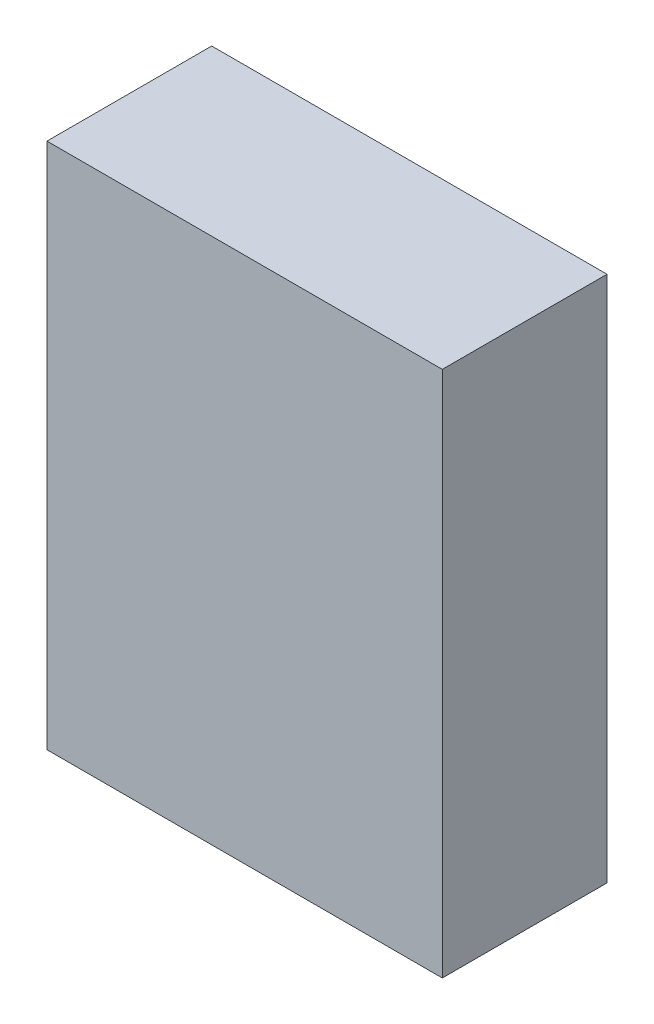
ISO-10303-21;
HEADER;
FILE_DESCRIPTION(('STEP AP214'),'2;1');
FILE_NAME('part.step','',(''),(''),'','','');
FILE_SCHEMA(('AUTOMOTIVE_DESIGN { 1 0 10303 214 1 1 1 1 }'));
ENDSEC;
DATA;
#1=APPLICATION_CONTEXT('core data for automotive mechanical design processes');
#2=APPLICATION_PROTOCOL_DEFINITION('international standard','automotive_design',2000,#1);
#3=PRODUCT_CONTEXT('',#1,'mechanical');
#4=PRODUCT('Part','Part','',(#3));
#5=PRODUCT_RELATED_PRODUCT_CATEGORY('part','',(#4));
#6=PRODUCT_DEFINITION_FORMATION('','',#4);
#7=PRODUCT_DEFINITION_CONTEXT('part definition',#1,'design');
#8=PRODUCT_DEFINITION('design','',#6,#7);
#9=PRODUCT_DEFINITION_SHAPE('','',#8);
#10=(LENGTH_UNIT() NAMED_UNIT(*) SI_UNIT(.MILLI.,.METRE.));
#11=(NAMED_UNIT(*) PLANE_ANGLE_UNIT() SI_UNIT($,.RADIAN.));
#12=(NAMED_UNIT(*) SI_UNIT($,.STERADIAN.) SOLID_ANGLE_UNIT());
#13=UNCERTAINTY_MEASURE_WITH_UNIT(LENGTH_MEASURE(1.E-05),#10,'distance_accuracy_value','');
#14=(GEOMETRIC_REPRESENTATION_CONTEXT(3) GLOBAL_UNCERTAINTY_ASSIGNED_CONTEXT((#13)) GLOBAL_UNIT_ASSIGNED_CONTEXT((#10,
#11,#12)) REPRESENTATION_CONTEXT('',''));
#15=CARTESIAN_POINT('',(0.,0.,0.));
#16=DIRECTION('',(0.,0.,1.));
#17=DIRECTION('',(1.,0.,0.));
#18=AXIS2_PLACEMENT_3D('',#15,#16,#17);
#19=CARTESIAN_POINT('',(300.,-400.,250.));
#20=DIRECTION('',(-1.,0.,0.));
#21=DIRECTION('',(0.,0.,1.));
#22=AXIS2_PLACEMENT_3D('',#19,#20,#21);
#23=PLANE('',#22);
#24=DIRECTION('',(0.,1.,0.));
#25=VECTOR('',#24,1.);
#26=CARTESIAN_POINT('',(300.,-400.,0.));
#27=LINE('',#26,#25);
#28=CARTESIAN_POINT('',(300.,-400.,0.));
#29=VERTEX_POINT('',#28);
#30=CARTESIAN_POINT('',(300.,400.,0.));
#31=VERTEX_POINT('',#30);
#32=EDGE_CURVE('E96',#29,#31,#27,.T.);
#33=ORIENTED_EDGE('',*,*,#32,.T.);
#34=DIRECTION('',(0.,0.,-1.));
#35=VECTOR('',#34,1.);
#36=CARTESIAN_POINT('',(300.,400.,250.));
#37=LINE('',#36,#35);
#38=CARTESIAN_POINT('',(300.,400.,250.));
#39=VERTEX_POINT('',#38);
#40=EDGE_CURVE('E11',#39,#31,#37,.T.);
#41=ORIENTED_EDGE('',*,*,#40,.F.);
#42=DIRECTION('',(0.,1.,0.));
#43=VECTOR('',#42,1.);
#44=CARTESIAN_POINT('',(300.,-400.,250.));
#45=LINE('',#44,#43);
#46=CARTESIAN_POINT('',(300.,-400.,250.));
#47=VERTEX_POINT('',#46);
#48=EDGE_CURVE('E84',#47,#39,#45,.T.);
#49=ORIENTED_EDGE('',*,*,#48,.F.);
#50=DIRECTION('',(0.,0.,-1.));
#51=VECTOR('',#50,1.);
#52=CARTESIAN_POINT('',(300.,-400.,250.));
#53=LINE('',#52,#51);
#54=EDGE_CURVE('E92',#47,#29,#53,.T.);
#55=ORIENTED_EDGE('',*,*,#54,.T.);
#56=EDGE_LOOP('',(#33,#41,#49,#55));
#57=FACE_BOUND('',#56,.T.);
#58=ADVANCED_FACE('F33',(#57),#23,.F.);
#59=CARTESIAN_POINT('',(-300.,400.,250.));
#60=DIRECTION('',(0.,-1.,0.));
#61=DIRECTION('',(0.,0.,-1.));
#62=AXIS2_PLACEMENT_3D('',#59,#60,#61);
#63=PLANE('',#62);
#64=DIRECTION('',(-1.,0.,0.));
#65=VECTOR('',#64,1.);
#66=CARTESIAN_POINT('',(-300.,400.,0.));
#67=LINE('',#66,#65);
#68=CARTESIAN_POINT('',(-300.,400.,0.));
#69=VERTEX_POINT('',#68);
#70=EDGE_CURVE('E88',#31,#69,#67,.T.);
#71=ORIENTED_EDGE('',*,*,#70,.T.);
#72=DIRECTION('',(0.,0.,-1.));
#73=VECTOR('',#72,1.);
#74=CARTESIAN_POINT('',(-300.,400.,250.));
#75=LINE('',#74,#73);
#76=CARTESIAN_POINT('',(-300.,400.,250.));
#77=VERTEX_POINT('',#76);
#78=EDGE_CURVE('E41',#77,#69,#75,.T.);
#79=ORIENTED_EDGE('',*,*,#78,.F.);
#80=DIRECTION('',(-1.,0.,0.));
#81=VECTOR('',#80,1.);
#82=CARTESIAN_POINT('',(-300.,400.,250.));
#83=LINE('',#82,#81);
#84=EDGE_CURVE('E79',#39,#77,#83,.T.);
#85=ORIENTED_EDGE('',*,*,#84,.F.);
#86=ORIENTED_EDGE('',*,*,#40,.T.);
#87=EDGE_LOOP('',(#71,#79,#85,#86));
#88=FACE_BOUND('',#87,.T.);
#89=ADVANCED_FACE('F87',(#88),#63,.F.);
#90=CARTESIAN_POINT('',(-300.,-400.,250.));
#91=DIRECTION('',(1.,0.,0.));
#92=DIRECTION('',(0.,0.,-1.));
#93=AXIS2_PLACEMENT_3D('',#90,#91,#92);
#94=PLANE('',#93);
#95=DIRECTION('',(0.,-1.,0.));
#96=VECTOR('',#95,1.);
#97=CARTESIAN_POINT('',(-300.,-400.,0.));
#98=LINE('',#97,#96);
#99=CARTESIAN_POINT('',(-300.,-400.,0.));
#100=VERTEX_POINT('',#99);
#101=EDGE_CURVE('E66',#69,#100,#98,.T.);
#102=ORIENTED_EDGE('',*,*,#101,.T.);
#103=DIRECTION('',(0.,0.,-1.));
#104=VECTOR('',#103,1.);
#105=CARTESIAN_POINT('',(-300.,-400.,250.));
#106=LINE('',#105,#104);
#107=CARTESIAN_POINT('',(-300.,-400.,250.));
#108=VERTEX_POINT('',#107);
#109=EDGE_CURVE('E89',#108,#100,#106,.T.);
#110=ORIENTED_EDGE('',*,*,#109,.F.);
#111=DIRECTION('',(0.,-1.,0.));
#112=VECTOR('',#111,1.);
#113=CARTESIAN_POINT('',(-300.,-400.,250.));
#114=LINE('',#113,#112);
#115=EDGE_CURVE('E82',#77,#108,#114,.T.);
#116=ORIENTED_EDGE('',*,*,#115,.F.);
#117=ORIENTED_EDGE('',*,*,#78,.T.);
#118=EDGE_LOOP('',(#102,#110,#116,#117));
#119=FACE_BOUND('',#118,.T.);
#120=ADVANCED_FACE('F90',(#119),#94,.F.);
#121=CARTESIAN_POINT('',(-300.,-400.,250.));
#122=DIRECTION('',(0.,1.,0.));
#123=DIRECTION('',(0.,0.,1.));
#124=AXIS2_PLACEMENT_3D('',#121,#122,#123);
#125=PLANE('',#124);
#126=DIRECTION('',(1.,0.,0.));
#127=VECTOR('',#126,1.);
#128=CARTESIAN_POINT('',(-300.,-400.,0.));
#129=LINE('',#128,#127);
#130=EDGE_CURVE('E72',#100,#29,#129,.T.);
#131=ORIENTED_EDGE('',*,*,#130,.T.);
#132=ORIENTED_EDGE('',*,*,#54,.F.);
#133=DIRECTION('',(1.,0.,0.));
#134=VECTOR('',#133,1.);
#135=CARTESIAN_POINT('',(-300.,-400.,250.));
#136=LINE('',#135,#134);
#137=EDGE_CURVE('E49',#108,#47,#136,.T.);
#138=ORIENTED_EDGE('',*,*,#137,.F.);
#139=ORIENTED_EDGE('',*,*,#109,.T.);
#140=EDGE_LOOP('',(#131,#132,#138,#139));
#141=FACE_BOUND('',#140,.T.);
#142=ADVANCED_FACE('F103',(#141),#125,.F.);
#143=CARTESIAN_POINT('',(0.,0.,250.));
#144=DIRECTION('',(0.,0.,-1.));
#145=DIRECTION('',(-1.,0.,0.));
#146=AXIS2_PLACEMENT_3D('',#143,#144,#145);
#147=PLANE('',#146);
#148=ORIENTED_EDGE('',*,*,#48,.T.);
#149=ORIENTED_EDGE('',*,*,#84,.T.);
#150=ORIENTED_EDGE('',*,*,#115,.T.);
#151=ORIENTED_EDGE('',*,*,#137,.T.);
#152=EDGE_LOOP('',(#148,#149,#150,#151));
#153=FACE_BOUND('',#152,.T.);
#154=ADVANCED_FACE('F80',(#153),#147,.F.);
#155=CARTESIAN_POINT('',(0.,0.,0.));
#156=DIRECTION('',(0.,0.,-1.));
#157=DIRECTION('',(-1.,0.,0.));
#158=AXIS2_PLACEMENT_3D('',#155,#156,#157);
#159=PLANE('',#158);
#160=ORIENTED_EDGE('',*,*,#32,.F.);
#161=ORIENTED_EDGE('',*,*,#130,.F.);
#162=ORIENTED_EDGE('',*,*,#101,.F.);
#163=ORIENTED_EDGE('',*,*,#70,.F.);
#164=EDGE_LOOP('',(#160,#161,#162,#163));
#165=FACE_BOUND('',#164,.T.);
#166=ADVANCED_FACE('F106',(#165),#159,.T.);
#167=CLOSED_SHELL('',(#58,#89,#120,#142,#154,#166));
#168=MANIFOLD_SOLID_BREP('B2',#167);
#169=ADVANCED_BREP_SHAPE_REPRESENTATION('',(#18,#168),#14);
#170=SHAPE_DEFINITION_REPRESENTATION(#9,#169);
ENDSEC;
END-ISO-10303-21;
